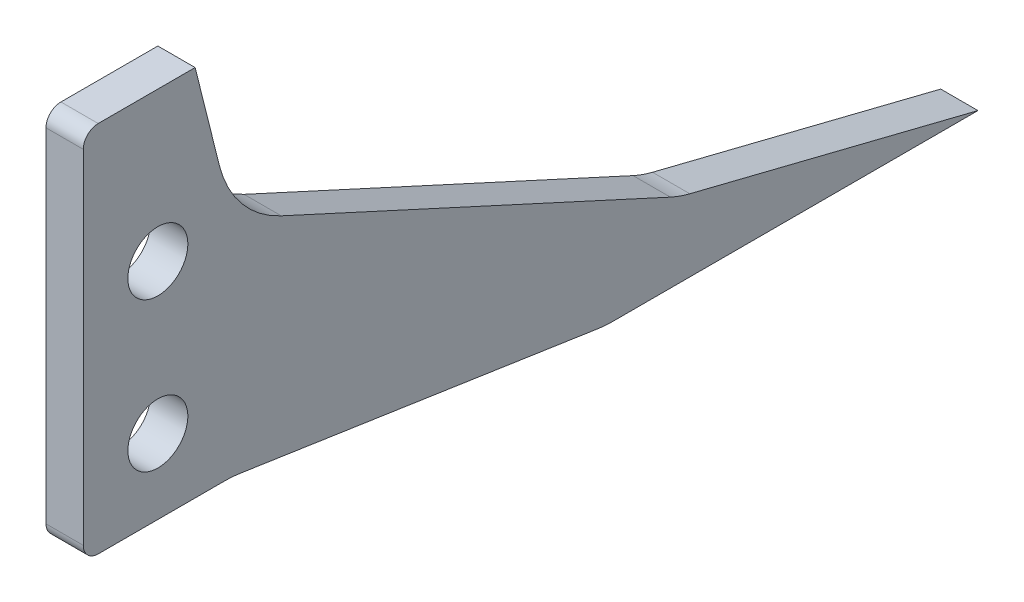
ISO-10303-21;
HEADER;
FILE_DESCRIPTION(('STEP AP214'),'2;1');
FILE_NAME('part.step','',(''),(''),'','','');
FILE_SCHEMA(('AUTOMOTIVE_DESIGN { 1 0 10303 214 1 1 1 1 }'));
ENDSEC;
DATA;
#1=APPLICATION_CONTEXT('core data for automotive mechanical design processes');
#2=APPLICATION_PROTOCOL_DEFINITION('international standard','automotive_design',2000,#1);
#3=PRODUCT_CONTEXT('',#1,'mechanical');
#4=PRODUCT('Part','Part','',(#3));
#5=PRODUCT_RELATED_PRODUCT_CATEGORY('part','',(#4));
#6=PRODUCT_DEFINITION_FORMATION('','',#4);
#7=PRODUCT_DEFINITION_CONTEXT('part definition',#1,'design');
#8=PRODUCT_DEFINITION('design','',#6,#7);
#9=PRODUCT_DEFINITION_SHAPE('','',#8);
#10=(LENGTH_UNIT() NAMED_UNIT(*) SI_UNIT(.MILLI.,.METRE.));
#11=(NAMED_UNIT(*) PLANE_ANGLE_UNIT() SI_UNIT($,.RADIAN.));
#12=(NAMED_UNIT(*) SI_UNIT($,.STERADIAN.) SOLID_ANGLE_UNIT());
#13=UNCERTAINTY_MEASURE_WITH_UNIT(LENGTH_MEASURE(1.E-05),#10,'distance_accuracy_value','');
#14=(GEOMETRIC_REPRESENTATION_CONTEXT(3) GLOBAL_UNCERTAINTY_ASSIGNED_CONTEXT((#13)) GLOBAL_UNIT_ASSIGNED_CONTEXT((#10,
#11,#12)) REPRESENTATION_CONTEXT('',''));
#15=CARTESIAN_POINT('',(0.,0.,0.));
#16=DIRECTION('',(0.,0.,1.));
#17=DIRECTION('',(1.,0.,0.));
#18=AXIS2_PLACEMENT_3D('',#15,#16,#17);
#19=CARTESIAN_POINT('',(28.575,-15.875,0.));
#20=DIRECTION('',(0.,0.,-1.));
#21=DIRECTION('',(-1.,0.,0.));
#22=AXIS2_PLACEMENT_3D('',#19,#20,#21);
#23=PLANE('',#22);
#24=DIRECTION('',(0.,-1.,0.));
#25=VECTOR('',#24,1.);
#26=CARTESIAN_POINT('',(25.4,-15.875,0.));
#27=LINE('',#26,#25);
#28=CARTESIAN_POINT('',(25.4,14.605,0.));
#29=VERTEX_POINT('',#28);
#30=CARTESIAN_POINT('',(25.4,-14.605,0.));
#31=VERTEX_POINT('',#30);
#32=EDGE_CURVE('E178',#29,#31,#27,.T.);
#33=ORIENTED_EDGE('',*,*,#32,.T.);
#34=DIRECTION('',(-1.,0.,0.));
#35=VECTOR('',#34,1.);
#36=CARTESIAN_POINT('',(28.575,-14.605,0.));
#37=LINE('',#36,#35);
#38=CARTESIAN_POINT('',(28.575,-14.605,0.));
#39=VERTEX_POINT('',#38);
#40=EDGE_CURVE('E58',#31,#39,#37,.F.);
#41=ORIENTED_EDGE('',*,*,#40,.T.);
#42=DIRECTION('',(0.,-1.,0.));
#43=VECTOR('',#42,1.);
#44=CARTESIAN_POINT('',(28.575,-15.875,0.));
#45=LINE('',#44,#43);
#46=CARTESIAN_POINT('',(28.575,14.605,0.));
#47=VERTEX_POINT('',#46);
#48=EDGE_CURVE('E196',#47,#39,#45,.T.);
#49=ORIENTED_EDGE('',*,*,#48,.F.);
#50=DIRECTION('',(-1.,0.,0.));
#51=VECTOR('',#50,1.);
#52=CARTESIAN_POINT('',(28.575,14.605,0.));
#53=LINE('',#52,#51);
#54=EDGE_CURVE('E240',#47,#29,#53,.T.);
#55=ORIENTED_EDGE('',*,*,#54,.T.);
#56=EDGE_LOOP('',(#33,#41,#49,#55));
#57=FACE_BOUND('',#56,.T.);
#58=ADVANCED_FACE('F37',(#57),#23,.F.);
#59=CARTESIAN_POINT('',(28.575,-15.875,-12.7));
#60=DIRECTION('',(0.,1.,0.));
#61=DIRECTION('',(0.,0.,1.));
#62=AXIS2_PLACEMENT_3D('',#59,#60,#61);
#63=PLANE('',#62);
#64=DIRECTION('',(0.,0.,-1.));
#65=VECTOR('',#64,1.);
#66=CARTESIAN_POINT('',(28.575,-15.875,-12.7));
#67=LINE('',#66,#65);
#68=CARTESIAN_POINT('',(28.575,-15.875,-1.27));
#69=VERTEX_POINT('',#68);
#70=CARTESIAN_POINT('',(28.575,-15.875,-11.9895987787025));
#71=VERTEX_POINT('',#70);
#72=EDGE_CURVE('E247',#69,#71,#67,.T.);
#73=ORIENTED_EDGE('',*,*,#72,.F.);
#74=DIRECTION('',(-1.,0.,0.));
#75=VECTOR('',#74,1.);
#76=CARTESIAN_POINT('',(28.575,-15.875,-1.27));
#77=LINE('',#76,#75);
#78=CARTESIAN_POINT('',(25.4,-15.875,-1.27));
#79=VERTEX_POINT('',#78);
#80=EDGE_CURVE('E233',#69,#79,#77,.T.);
#81=ORIENTED_EDGE('',*,*,#80,.T.);
#82=DIRECTION('',(0.,0.,-1.));
#83=VECTOR('',#82,1.);
#84=CARTESIAN_POINT('',(25.4,-15.875,-12.7));
#85=LINE('',#84,#83);
#86=CARTESIAN_POINT('',(25.4,-15.875,-11.9895987787025));
#87=VERTEX_POINT('',#86);
#88=EDGE_CURVE('E180',#79,#87,#85,.T.);
#89=ORIENTED_EDGE('',*,*,#88,.T.);
#90=DIRECTION('',(-1.,0.,0.));
#91=VECTOR('',#90,1.);
#92=CARTESIAN_POINT('',(28.575,-15.875,-11.9895987787025));
#93=LINE('',#92,#91);
#94=EDGE_CURVE('E203',#87,#71,#93,.F.);
#95=ORIENTED_EDGE('',*,*,#94,.T.);
#96=EDGE_LOOP('',(#73,#81,#89,#95));
#97=FACE_BOUND('',#96,.T.);
#98=ADVANCED_FACE('F251',(#97),#63,.F.);
#99=CARTESIAN_POINT('',(28.575,-20.6375,-44.45));
#100=DIRECTION('',(0.,0.988936352868298,-0.148340452930244));
#101=DIRECTION('',(0.,0.148340452930244,0.988936352868298));
#102=AXIS2_PLACEMENT_3D('',#99,#100,#101);
#103=PLANE('',#102);
#104=DIRECTION('',(0.,-0.148340452930244,-0.988936352868298));
#105=VECTOR('',#104,1.);
#106=CARTESIAN_POINT('',(28.575,-20.6375,-44.45));
#107=LINE('',#106,#105);
#108=CARTESIAN_POINT('',(28.575,-15.9803812389295,-13.4025415928631));
#109=VERTEX_POINT('',#108);
#110=CARTESIAN_POINT('',(28.575,-20.5321187610705,-43.7474584071369));
#111=VERTEX_POINT('',#110);
#112=EDGE_CURVE('E152',#109,#111,#107,.T.);
#113=ORIENTED_EDGE('',*,*,#112,.F.);
#114=DIRECTION('',(-1.,0.,0.));
#115=VECTOR('',#114,1.);
#116=CARTESIAN_POINT('',(25.4,-15.9803812389295,-13.4025415928631));
#117=LINE('',#116,#115);
#118=CARTESIAN_POINT('',(25.4,-15.9803812389295,-13.4025415928631));
#119=VERTEX_POINT('',#118);
#120=EDGE_CURVE('E200',#109,#119,#117,.T.);
#121=ORIENTED_EDGE('',*,*,#120,.T.);
#122=DIRECTION('',(0.,-0.148340452930244,-0.988936352868298));
#123=VECTOR('',#122,1.);
#124=CARTESIAN_POINT('',(25.4,-20.6375,-44.45));
#125=LINE('',#124,#123);
#126=CARTESIAN_POINT('',(25.4,-20.5321187610705,-43.7474584071369));
#127=VERTEX_POINT('',#126);
#128=EDGE_CURVE('E183',#119,#127,#125,.T.);
#129=ORIENTED_EDGE('',*,*,#128,.T.);
#130=DIRECTION('',(-1.,0.,0.));
#131=VECTOR('',#130,1.);
#132=CARTESIAN_POINT('',(28.575,-20.5321187610705,-43.7474584071369));
#133=LINE('',#132,#131);
#134=EDGE_CURVE('E162',#127,#111,#133,.F.);
#135=ORIENTED_EDGE('',*,*,#134,.T.);
#136=EDGE_LOOP('',(#113,#121,#129,#135));
#137=FACE_BOUND('',#136,.T.);
#138=ADVANCED_FACE('F287',(#137),#103,.F.);
#139=CARTESIAN_POINT('',(28.575,-20.6375,-76.2));
#140=DIRECTION('',(0.,1.,0.));
#141=DIRECTION('',(0.,0.,1.));
#142=AXIS2_PLACEMENT_3D('',#139,#140,#141);
#143=PLANE('',#142);
#144=DIRECTION('',(0.,0.,-1.));
#145=VECTOR('',#144,1.);
#146=CARTESIAN_POINT('',(28.575,-20.6375,-76.2));
#147=LINE('',#146,#145);
#148=CARTESIAN_POINT('',(28.575,-20.6375,-45.1604012212975));
#149=VERTEX_POINT('',#148);
#150=CARTESIAN_POINT('',(28.575,-20.6375,-76.2));
#151=VERTEX_POINT('',#150);
#152=EDGE_CURVE('E140',#149,#151,#147,.T.);
#153=ORIENTED_EDGE('',*,*,#152,.F.);
#154=DIRECTION('',(-1.,0.,0.));
#155=VECTOR('',#154,1.);
#156=CARTESIAN_POINT('',(28.575,-20.6375,-45.1604012212975));
#157=LINE('',#156,#155);
#158=CARTESIAN_POINT('',(25.4,-20.6375,-45.1604012212975));
#159=VERTEX_POINT('',#158);
#160=EDGE_CURVE('E206',#149,#159,#157,.T.);
#161=ORIENTED_EDGE('',*,*,#160,.T.);
#162=DIRECTION('',(0.,0.,-1.));
#163=VECTOR('',#162,1.);
#164=CARTESIAN_POINT('',(25.4,-20.6375,-76.2));
#165=LINE('',#164,#163);
#166=CARTESIAN_POINT('',(25.4,-20.6375,-76.2));
#167=VERTEX_POINT('',#166);
#168=EDGE_CURVE('E158',#159,#167,#165,.T.);
#169=ORIENTED_EDGE('',*,*,#168,.T.);
#170=DIRECTION('',(-1.,0.,0.));
#171=VECTOR('',#170,1.);
#172=CARTESIAN_POINT('',(28.575,-20.6375,-76.2));
#173=LINE('',#172,#171);
#174=EDGE_CURVE('E155',#151,#167,#173,.T.);
#175=ORIENTED_EDGE('',*,*,#174,.F.);
#176=EDGE_LOOP('',(#153,#161,#169,#175));
#177=FACE_BOUND('',#176,.T.);
#178=ADVANCED_FACE('F156',(#177),#143,.F.);
#179=CARTESIAN_POINT('',(28.575,-20.6375,-76.2));
#180=DIRECTION('',(0.,-0.970142500145332,0.242535625036333));
#181=DIRECTION('',(0.,-0.242535625036333,-0.970142500145332));
#182=AXIS2_PLACEMENT_3D('',#179,#180,#181);
#183=PLANE('',#182);
#184=DIRECTION('',(0.,0.242535625036333,0.970142500145332));
#185=VECTOR('',#184,1.);
#186=CARTESIAN_POINT('',(25.4,-20.6375,-76.2));
#187=LINE('',#186,#185);
#188=CARTESIAN_POINT('',(25.4,-14.5015485079578,-51.656194031831));
#189=VERTEX_POINT('',#188);
#190=EDGE_CURVE('E187',#167,#189,#187,.T.);
#191=ORIENTED_EDGE('',*,*,#190,.T.);
#192=DIRECTION('',(-1.,0.,0.));
#193=VECTOR('',#192,1.);
#194=CARTESIAN_POINT('',(28.575,-14.5015485079578,-51.656194031831));
#195=LINE('',#194,#193);
#196=CARTESIAN_POINT('',(28.575,-14.5015485079578,-51.656194031831));
#197=VERTEX_POINT('',#196);
#198=EDGE_CURVE('E167',#189,#197,#195,.F.);
#199=ORIENTED_EDGE('',*,*,#198,.T.);
#200=DIRECTION('',(0.,0.242535625036333,0.970142500145332));
#201=VECTOR('',#200,1.);
#202=CARTESIAN_POINT('',(28.575,-20.6375,-76.2));
#203=LINE('',#202,#201);
#204=EDGE_CURVE('E144',#151,#197,#203,.T.);
#205=ORIENTED_EDGE('',*,*,#204,.F.);
#206=ORIENTED_EDGE('',*,*,#174,.T.);
#207=EDGE_LOOP('',(#191,#199,#205,#206));
#208=FACE_BOUND('',#207,.T.);
#209=ADVANCED_FACE('F165',(#208),#183,.F.);
#210=CARTESIAN_POINT('',(28.575,3.175,-12.7));
#211=DIRECTION('',(0.,-0.909064822894284,0.416654710493214));
#212=DIRECTION('',(0.,-0.416654710493214,-0.909064822894284));
#213=AXIS2_PLACEMENT_3D('',#210,#211,#212);
#214=PLANE('',#213);
#215=DIRECTION('',(0.,0.416654710493214,0.909064822894284));
#216=VECTOR('',#215,1.);
#217=CARTESIAN_POINT('',(28.575,3.175,-12.7));
#218=LINE('',#217,#216);
#219=CARTESIAN_POINT('',(28.575,-13.9197836321415,-49.9977097428542));
#220=VERTEX_POINT('',#219);
#221=CARTESIAN_POINT('',(28.575,1.26757487132193,-16.8616548262067));
#222=VERTEX_POINT('',#221);
#223=EDGE_CURVE('E168',#220,#222,#218,.T.);
#224=ORIENTED_EDGE('',*,*,#223,.F.);
#225=DIRECTION('',(-1.,0.,0.));
#226=VECTOR('',#225,1.);
#227=CARTESIAN_POINT('',(25.4,-13.9197836321415,-49.9977097428542));
#228=LINE('',#227,#226);
#229=CARTESIAN_POINT('',(25.4,-13.9197836321415,-49.9977097428542));
#230=VERTEX_POINT('',#229);
#231=EDGE_CURVE('E213',#220,#230,#228,.T.);
#232=ORIENTED_EDGE('',*,*,#231,.T.);
#233=DIRECTION('',(0.,0.416654710493214,0.909064822894284));
#234=VECTOR('',#233,1.);
#235=CARTESIAN_POINT('',(25.4,3.175,-12.7));
#236=LINE('',#235,#234);
#237=CARTESIAN_POINT('',(25.4,1.26757487132193,-16.8616548262067));
#238=VERTEX_POINT('',#237);
#239=EDGE_CURVE('E189',#230,#238,#236,.T.);
#240=ORIENTED_EDGE('',*,*,#239,.T.);
#241=DIRECTION('',(-1.,0.,0.));
#242=VECTOR('',#241,1.);
#243=CARTESIAN_POINT('',(28.575,1.26757487132194,-16.8616548262067));
#244=LINE('',#243,#242);
#245=EDGE_CURVE('E211',#238,#222,#244,.F.);
#246=ORIENTED_EDGE('',*,*,#245,.T.);
#247=EDGE_LOOP('',(#224,#232,#240,#246));
#248=FACE_BOUND('',#247,.T.);
#249=ADVANCED_FACE('F276',(#248),#214,.F.);
#250=CARTESIAN_POINT('',(28.575,15.875,-9.525));
#251=DIRECTION('',(0.,-0.242535625036333,0.970142500145332));
#252=DIRECTION('',(0.,-0.970142500145332,-0.242535625036333));
#253=AXIS2_PLACEMENT_3D('',#250,#251,#252);
#254=PLANE('',#253);
#255=DIRECTION('',(0.,0.970142500145332,0.242535625036333));
#256=VECTOR('',#255,1.);
#257=CARTESIAN_POINT('',(28.575,15.875,-9.525));
#258=LINE('',#257,#256);
#259=CARTESIAN_POINT('',(28.575,7.61626548091892,-11.5896836297703));
#260=VERTEX_POINT('',#259);
#261=CARTESIAN_POINT('',(28.575,15.875,-9.525));
#262=VERTEX_POINT('',#261);
#263=EDGE_CURVE('E171',#260,#262,#258,.T.);
#264=ORIENTED_EDGE('',*,*,#263,.F.);
#265=DIRECTION('',(-1.,0.,0.));
#266=VECTOR('',#265,1.);
#267=CARTESIAN_POINT('',(25.4,7.61626548091892,-11.5896836297703));
#268=LINE('',#267,#266);
#269=CARTESIAN_POINT('',(25.4,7.61626548091892,-11.5896836297703));
#270=VERTEX_POINT('',#269);
#271=EDGE_CURVE('E217',#260,#270,#268,.T.);
#272=ORIENTED_EDGE('',*,*,#271,.T.);
#273=DIRECTION('',(0.,0.970142500145332,0.242535625036333));
#274=VECTOR('',#273,1.);
#275=CARTESIAN_POINT('',(25.4,15.875,-9.525));
#276=LINE('',#275,#274);
#277=CARTESIAN_POINT('',(25.4,15.875,-9.525));
#278=VERTEX_POINT('',#277);
#279=EDGE_CURVE('E192',#270,#278,#276,.T.);
#280=ORIENTED_EDGE('',*,*,#279,.T.);
#281=DIRECTION('',(-1.,0.,0.));
#282=VECTOR('',#281,1.);
#283=CARTESIAN_POINT('',(28.575,15.875,-9.525));
#284=LINE('',#283,#282);
#285=EDGE_CURVE('E163',#262,#278,#284,.T.);
#286=ORIENTED_EDGE('',*,*,#285,.F.);
#287=EDGE_LOOP('',(#264,#272,#280,#286));
#288=FACE_BOUND('',#287,.T.);
#289=ADVANCED_FACE('F269',(#288),#254,.F.);
#290=CARTESIAN_POINT('',(28.575,15.875,0.));
#291=DIRECTION('',(0.,-1.,0.));
#292=DIRECTION('',(0.,0.,-1.));
#293=AXIS2_PLACEMENT_3D('',#290,#291,#292);
#294=PLANE('',#293);
#295=DIRECTION('',(0.,0.,1.));
#296=VECTOR('',#295,1.);
#297=CARTESIAN_POINT('',(25.4,15.875,0.));
#298=LINE('',#297,#296);
#299=CARTESIAN_POINT('',(25.4,15.875,-1.27));
#300=VERTEX_POINT('',#299);
#301=EDGE_CURVE('E194',#278,#300,#298,.T.);
#302=ORIENTED_EDGE('',*,*,#301,.T.);
#303=DIRECTION('',(-1.,0.,0.));
#304=VECTOR('',#303,1.);
#305=CARTESIAN_POINT('',(28.575,15.875,-1.27));
#306=LINE('',#305,#304);
#307=CARTESIAN_POINT('',(28.575,15.875,-1.27));
#308=VERTEX_POINT('',#307);
#309=EDGE_CURVE('E11',#300,#308,#306,.F.);
#310=ORIENTED_EDGE('',*,*,#309,.T.);
#311=DIRECTION('',(0.,0.,1.));
#312=VECTOR('',#311,1.);
#313=CARTESIAN_POINT('',(28.575,15.875,0.));
#314=LINE('',#313,#312);
#315=EDGE_CURVE('E176',#262,#308,#314,.T.);
#316=ORIENTED_EDGE('',*,*,#315,.F.);
#317=ORIENTED_EDGE('',*,*,#285,.T.);
#318=EDGE_LOOP('',(#302,#310,#316,#317));
#319=FACE_BOUND('',#318,.T.);
#320=ADVANCED_FACE('F265',(#319),#294,.F.);
#321=CARTESIAN_POINT('',(28.575,0.,0.));
#322=DIRECTION('',(-1.,0.,0.));
#323=DIRECTION('',(0.,0.,1.));
#324=AXIS2_PLACEMENT_3D('',#321,#322,#323);
#325=PLANE('',#324);
#326=CARTESIAN_POINT('',(28.575,3.175,-6.35));
#327=DIRECTION('',(-1.,0.,0.));
#328=DIRECTION('',(0.,0.,1.));
#329=AXIS2_PLACEMENT_3D('',#326,#327,#328);
#330=CIRCLE('',#329,2.5527);
#331=CARTESIAN_POINT('',(28.575,3.175,-3.7973));
#332=VERTEX_POINT('',#331);
#333=EDGE_CURVE('E181',#332,#332,#330,.T.);
#334=ORIENTED_EDGE('',*,*,#333,.T.);
#335=EDGE_LOOP('',(#334));
#336=FACE_BOUND('',#335,.T.);
#337=CARTESIAN_POINT('',(28.575,-9.525,-6.35));
#338=DIRECTION('',(-1.,0.,0.));
#339=DIRECTION('',(0.,0.,1.));
#340=AXIS2_PLACEMENT_3D('',#337,#338,#339);
#341=CIRCLE('',#340,2.5527);
#342=CARTESIAN_POINT('',(28.575,-9.525,-3.7973));
#343=VERTEX_POINT('',#342);
#344=EDGE_CURVE('E340',#343,#343,#341,.T.);
#345=ORIENTED_EDGE('',*,*,#344,.T.);
#346=EDGE_LOOP('',(#345));
#347=FACE_BOUND('',#346,.T.);
#348=ORIENTED_EDGE('',*,*,#48,.T.);
#349=CARTESIAN_POINT('',(28.575,-14.605,-1.27));
#350=DIRECTION('',(-1.,0.,0.));
#351=DIRECTION('',(0.,0.,1.));
#352=AXIS2_PLACEMENT_3D('',#349,#350,#351);
#353=CIRCLE('',#352,1.27);
#354=EDGE_CURVE('E45',#39,#69,#353,.F.);
#355=ORIENTED_EDGE('',*,*,#354,.T.);
#356=ORIENTED_EDGE('',*,*,#72,.T.);
#357=CARTESIAN_POINT('',(28.575,-25.4,-11.9895987787025));
#358=DIRECTION('',(-1.,0.,0.));
#359=DIRECTION('',(0.,0.,1.));
#360=AXIS2_PLACEMENT_3D('',#357,#358,#359);
#361=CIRCLE('',#360,9.525);
#362=EDGE_CURVE('E223',#71,#109,#361,.T.);
#363=ORIENTED_EDGE('',*,*,#362,.T.);
#364=ORIENTED_EDGE('',*,*,#112,.T.);
#365=CARTESIAN_POINT('',(28.575,-11.1125,-45.1604012212975));
#366=DIRECTION('',(-1.,0.,0.));
#367=DIRECTION('',(0.,0.,1.));
#368=AXIS2_PLACEMENT_3D('',#365,#366,#367);
#369=CIRCLE('',#368,9.525);
#370=EDGE_CURVE('E148',#111,#149,#369,.F.);
#371=ORIENTED_EDGE('',*,*,#370,.T.);
#372=ORIENTED_EDGE('',*,*,#152,.T.);
#373=ORIENTED_EDGE('',*,*,#204,.T.);
#374=CARTESIAN_POINT('',(28.575,-5.26094119407347,-53.9663458603021));
#375=DIRECTION('',(-1.,0.,0.));
#376=DIRECTION('',(0.,0.,1.));
#377=AXIS2_PLACEMENT_3D('',#374,#375,#376);
#378=CIRCLE('',#377,9.525);
#379=EDGE_CURVE('E227',#197,#220,#378,.T.);
#380=ORIENTED_EDGE('',*,*,#379,.T.);
#381=ORIENTED_EDGE('',*,*,#223,.T.);
#382=CARTESIAN_POINT('',(28.575,9.92641730938999,-20.8302909436546));
#383=DIRECTION('',(-1.,0.,0.));
#384=DIRECTION('',(0.,0.,1.));
#385=AXIS2_PLACEMENT_3D('',#382,#383,#384);
#386=CIRCLE('',#385,9.525);
#387=EDGE_CURVE('E231',#222,#260,#386,.T.);
#388=ORIENTED_EDGE('',*,*,#387,.T.);
#389=ORIENTED_EDGE('',*,*,#263,.T.);
#390=ORIENTED_EDGE('',*,*,#315,.T.);
#391=CARTESIAN_POINT('',(28.575,14.605,-1.27));
#392=DIRECTION('',(-1.,0.,0.));
#393=DIRECTION('',(0.,0.,1.));
#394=AXIS2_PLACEMENT_3D('',#391,#392,#393);
#395=CIRCLE('',#394,1.27);
#396=EDGE_CURVE('E244',#308,#47,#395,.F.);
#397=ORIENTED_EDGE('',*,*,#396,.T.);
#398=EDGE_LOOP('',(#348,#355,#356,#363,#364,#371,#372,#373,#380,#381,#388,#389,#390,#397));
#399=FACE_BOUND('',#398,.T.);
#400=ADVANCED_FACE('F142',(#336,#347,#399),#325,.F.);
#401=CARTESIAN_POINT('',(25.4,0.,0.));
#402=DIRECTION('',(-1.,0.,0.));
#403=DIRECTION('',(0.,0.,1.));
#404=AXIS2_PLACEMENT_3D('',#401,#402,#403);
#405=PLANE('',#404);
#406=CARTESIAN_POINT('',(25.4,3.175,-6.35));
#407=DIRECTION('',(-1.,0.,0.));
#408=DIRECTION('',(0.,0.,1.));
#409=AXIS2_PLACEMENT_3D('',#406,#407,#408);
#410=CIRCLE('',#409,2.5527);
#411=CARTESIAN_POINT('',(25.4,3.175,-3.7973));
#412=VERTEX_POINT('',#411);
#413=EDGE_CURVE('E337',#412,#412,#410,.T.);
#414=ORIENTED_EDGE('',*,*,#413,.F.);
#415=EDGE_LOOP('',(#414));
#416=FACE_BOUND('',#415,.T.);
#417=CARTESIAN_POINT('',(25.4,-9.525,-6.35));
#418=DIRECTION('',(-1.,0.,0.));
#419=DIRECTION('',(0.,0.,1.));
#420=AXIS2_PLACEMENT_3D('',#417,#418,#419);
#421=CIRCLE('',#420,2.5527);
#422=CARTESIAN_POINT('',(25.4,-9.525,-3.7973));
#423=VERTEX_POINT('',#422);
#424=EDGE_CURVE('E346',#423,#423,#421,.T.);
#425=ORIENTED_EDGE('',*,*,#424,.F.);
#426=EDGE_LOOP('',(#425));
#427=FACE_BOUND('',#426,.T.);
#428=ORIENTED_EDGE('',*,*,#88,.F.);
#429=CARTESIAN_POINT('',(25.4,-14.605,-1.27));
#430=DIRECTION('',(-1.,0.,0.));
#431=DIRECTION('',(0.,0.,1.));
#432=AXIS2_PLACEMENT_3D('',#429,#430,#431);
#433=CIRCLE('',#432,1.27);
#434=EDGE_CURVE('E238',#79,#31,#433,.T.);
#435=ORIENTED_EDGE('',*,*,#434,.T.);
#436=ORIENTED_EDGE('',*,*,#32,.F.);
#437=CARTESIAN_POINT('',(25.4,14.605,-1.27));
#438=DIRECTION('',(-1.,0.,0.));
#439=DIRECTION('',(0.,0.,1.));
#440=AXIS2_PLACEMENT_3D('',#437,#438,#439);
#441=CIRCLE('',#440,1.27);
#442=EDGE_CURVE('E236',#29,#300,#441,.T.);
#443=ORIENTED_EDGE('',*,*,#442,.T.);
#444=ORIENTED_EDGE('',*,*,#301,.F.);
#445=ORIENTED_EDGE('',*,*,#279,.F.);
#446=CARTESIAN_POINT('',(25.4,9.92641730938999,-20.8302909436546));
#447=DIRECTION('',(-1.,0.,0.));
#448=DIRECTION('',(0.,0.,1.));
#449=AXIS2_PLACEMENT_3D('',#446,#447,#448);
#450=CIRCLE('',#449,9.525);
#451=EDGE_CURVE('E229',#270,#238,#450,.F.);
#452=ORIENTED_EDGE('',*,*,#451,.T.);
#453=ORIENTED_EDGE('',*,*,#239,.F.);
#454=CARTESIAN_POINT('',(25.4,-5.26094119407347,-53.9663458603021));
#455=DIRECTION('',(-1.,0.,0.));
#456=DIRECTION('',(0.,0.,1.));
#457=AXIS2_PLACEMENT_3D('',#454,#455,#456);
#458=CIRCLE('',#457,9.525);
#459=EDGE_CURVE('E225',#230,#189,#458,.F.);
#460=ORIENTED_EDGE('',*,*,#459,.T.);
#461=ORIENTED_EDGE('',*,*,#190,.F.);
#462=ORIENTED_EDGE('',*,*,#168,.F.);
#463=CARTESIAN_POINT('',(25.4,-11.1125,-45.1604012212975));
#464=DIRECTION('',(-1.,0.,0.));
#465=DIRECTION('',(0.,0.,1.));
#466=AXIS2_PLACEMENT_3D('',#463,#464,#465);
#467=CIRCLE('',#466,9.525);
#468=EDGE_CURVE('E208',#159,#127,#467,.T.);
#469=ORIENTED_EDGE('',*,*,#468,.T.);
#470=ORIENTED_EDGE('',*,*,#128,.F.);
#471=CARTESIAN_POINT('',(25.4,-25.4,-11.9895987787025));
#472=DIRECTION('',(-1.,0.,0.));
#473=DIRECTION('',(0.,0.,1.));
#474=AXIS2_PLACEMENT_3D('',#471,#472,#473);
#475=CIRCLE('',#474,9.525);
#476=EDGE_CURVE('E220',#119,#87,#475,.F.);
#477=ORIENTED_EDGE('',*,*,#476,.T.);
#478=EDGE_LOOP('',(#428,#435,#436,#443,#444,#445,#452,#453,#460,#461,#462,#469,#470,#477));
#479=FACE_BOUND('',#478,.T.);
#480=ADVANCED_FACE('F259',(#416,#427,#479),#405,.T.);
#481=CARTESIAN_POINT('',(57.15,-9.525,-6.35));
#482=DIRECTION('',(-1.,0.,0.));
#483=DIRECTION('',(0.,0.,1.));
#484=AXIS2_PLACEMENT_3D('',#481,#482,#483);
#485=CYLINDRICAL_SURFACE('',#484,2.5527);
#486=ORIENTED_EDGE('',*,*,#424,.T.);
#487=EDGE_LOOP('',(#486));
#488=FACE_BOUND('',#487,.T.);
#489=ORIENTED_EDGE('',*,*,#344,.F.);
#490=EDGE_LOOP('',(#489));
#491=FACE_BOUND('',#490,.T.);
#492=ADVANCED_FACE('F322',(#488,#491),#485,.F.);
#493=CARTESIAN_POINT('',(57.15,3.175,-6.35));
#494=DIRECTION('',(-1.,0.,0.));
#495=DIRECTION('',(0.,0.,1.));
#496=AXIS2_PLACEMENT_3D('',#493,#494,#495);
#497=CYLINDRICAL_SURFACE('',#496,2.5527);
#498=ORIENTED_EDGE('',*,*,#413,.T.);
#499=EDGE_LOOP('',(#498));
#500=FACE_BOUND('',#499,.T.);
#501=ORIENTED_EDGE('',*,*,#333,.F.);
#502=EDGE_LOOP('',(#501));
#503=FACE_BOUND('',#502,.T.);
#504=ADVANCED_FACE('F298',(#500,#503),#497,.F.);
#505=CARTESIAN_POINT('',(28.575,-25.4,-11.9895987787025));
#506=DIRECTION('',(1.,0.,0.));
#507=DIRECTION('',(0.,0.,-1.));
#508=AXIS2_PLACEMENT_3D('',#505,#506,#507);
#509=CYLINDRICAL_SURFACE('',#508,9.525);
#510=ORIENTED_EDGE('',*,*,#362,.F.);
#511=ORIENTED_EDGE('',*,*,#94,.F.);
#512=ORIENTED_EDGE('',*,*,#476,.F.);
#513=ORIENTED_EDGE('',*,*,#120,.F.);
#514=EDGE_LOOP('',(#510,#511,#512,#513));
#515=FACE_BOUND('',#514,.T.);
#516=ADVANCED_FACE('F291',(#515),#509,.F.);
#517=CARTESIAN_POINT('',(28.575,-11.1125,-45.1604012212975));
#518=DIRECTION('',(-1.,0.,0.));
#519=DIRECTION('',(0.,0.,1.));
#520=AXIS2_PLACEMENT_3D('',#517,#518,#519);
#521=CYLINDRICAL_SURFACE('',#520,9.525);
#522=ORIENTED_EDGE('',*,*,#370,.F.);
#523=ORIENTED_EDGE('',*,*,#134,.F.);
#524=ORIENTED_EDGE('',*,*,#468,.F.);
#525=ORIENTED_EDGE('',*,*,#160,.F.);
#526=EDGE_LOOP('',(#522,#523,#524,#525));
#527=FACE_BOUND('',#526,.T.);
#528=ADVANCED_FACE('F289',(#527),#521,.T.);
#529=CARTESIAN_POINT('',(28.575,-5.26094119407347,-53.9663458603021));
#530=DIRECTION('',(1.,0.,0.));
#531=DIRECTION('',(0.,0.,-1.));
#532=AXIS2_PLACEMENT_3D('',#529,#530,#531);
#533=CYLINDRICAL_SURFACE('',#532,9.525);
#534=ORIENTED_EDGE('',*,*,#379,.F.);
#535=ORIENTED_EDGE('',*,*,#198,.F.);
#536=ORIENTED_EDGE('',*,*,#459,.F.);
#537=ORIENTED_EDGE('',*,*,#231,.F.);
#538=EDGE_LOOP('',(#534,#535,#536,#537));
#539=FACE_BOUND('',#538,.T.);
#540=ADVANCED_FACE('F281',(#539),#533,.F.);
#541=CARTESIAN_POINT('',(28.575,9.92641730938999,-20.8302909436546));
#542=DIRECTION('',(1.,0.,0.));
#543=DIRECTION('',(0.,0.,-1.));
#544=AXIS2_PLACEMENT_3D('',#541,#542,#543);
#545=CYLINDRICAL_SURFACE('',#544,9.525);
#546=ORIENTED_EDGE('',*,*,#387,.F.);
#547=ORIENTED_EDGE('',*,*,#245,.F.);
#548=ORIENTED_EDGE('',*,*,#451,.F.);
#549=ORIENTED_EDGE('',*,*,#271,.F.);
#550=EDGE_LOOP('',(#546,#547,#548,#549));
#551=FACE_BOUND('',#550,.T.);
#552=ADVANCED_FACE('F279',(#551),#545,.F.);
#553=CARTESIAN_POINT('',(28.575,-14.605,-1.27));
#554=DIRECTION('',(-1.,0.,0.));
#555=DIRECTION('',(0.,0.,1.));
#556=AXIS2_PLACEMENT_3D('',#553,#554,#555);
#557=CYLINDRICAL_SURFACE('',#556,1.27);
#558=ORIENTED_EDGE('',*,*,#354,.F.);
#559=ORIENTED_EDGE('',*,*,#40,.F.);
#560=ORIENTED_EDGE('',*,*,#434,.F.);
#561=ORIENTED_EDGE('',*,*,#80,.F.);
#562=EDGE_LOOP('',(#558,#559,#560,#561));
#563=FACE_BOUND('',#562,.T.);
#564=ADVANCED_FACE('F256',(#563),#557,.T.);
#565=CARTESIAN_POINT('',(28.575,14.605,-1.27));
#566=DIRECTION('',(-1.,0.,0.));
#567=DIRECTION('',(0.,0.,1.));
#568=AXIS2_PLACEMENT_3D('',#565,#566,#567);
#569=CYLINDRICAL_SURFACE('',#568,1.27);
#570=ORIENTED_EDGE('',*,*,#396,.F.);
#571=ORIENTED_EDGE('',*,*,#309,.F.);
#572=ORIENTED_EDGE('',*,*,#442,.F.);
#573=ORIENTED_EDGE('',*,*,#54,.F.);
#574=EDGE_LOOP('',(#570,#571,#572,#573));
#575=FACE_BOUND('',#574,.T.);
#576=ADVANCED_FACE('F39',(#575),#569,.T.);
#577=CLOSED_SHELL('',(#58,#98,#138,#178,#209,#249,#289,#320,#400,#480,#492,#504,#516,#528,#540,
#552,#564,#576));
#578=MANIFOLD_SOLID_BREP('B2',#577);
#579=ADVANCED_BREP_SHAPE_REPRESENTATION('',(#18,#578),#14);
#580=SHAPE_DEFINITION_REPRESENTATION(#9,#579);
ENDSEC;
END-ISO-10303-21;
